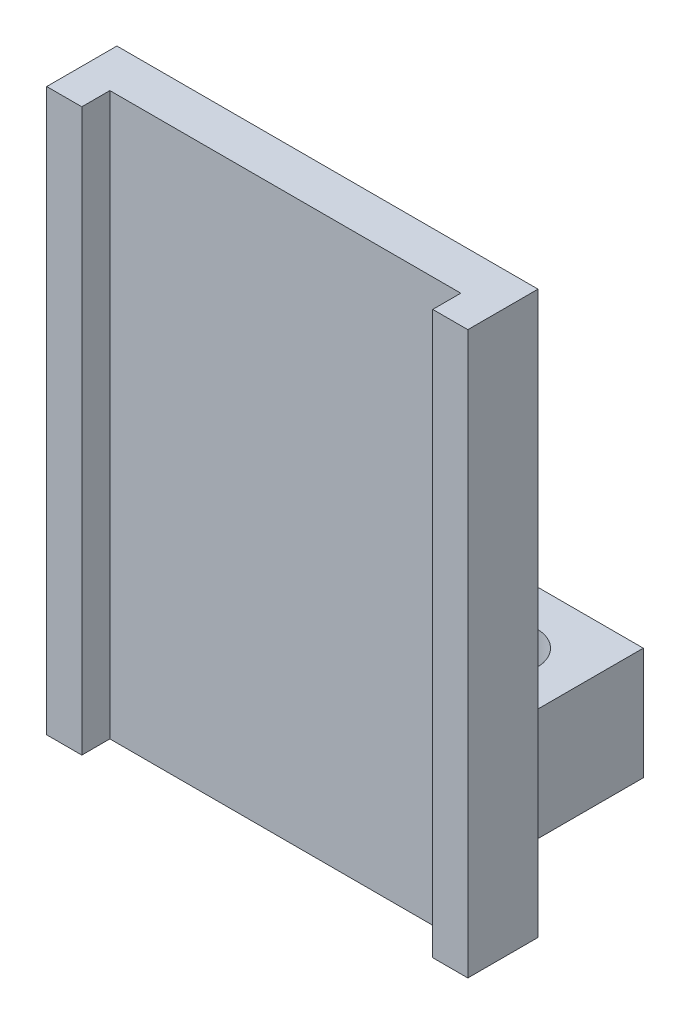
ISO-10303-21;
HEADER;
FILE_DESCRIPTION(('STEP AP214'),'2;1');
FILE_NAME('part.step','',(''),(''),'','','');
FILE_SCHEMA(('AUTOMOTIVE_DESIGN { 1 0 10303 214 1 1 1 1 }'));
ENDSEC;
DATA;
#1=APPLICATION_CONTEXT('core data for automotive mechanical design processes');
#2=APPLICATION_PROTOCOL_DEFINITION('international standard','automotive_design',2000,#1);
#3=PRODUCT_CONTEXT('',#1,'mechanical');
#4=PRODUCT('Part','Part','',(#3));
#5=PRODUCT_RELATED_PRODUCT_CATEGORY('part','',(#4));
#6=PRODUCT_DEFINITION_FORMATION('','',#4);
#7=PRODUCT_DEFINITION_CONTEXT('part definition',#1,'design');
#8=PRODUCT_DEFINITION('design','',#6,#7);
#9=PRODUCT_DEFINITION_SHAPE('','',#8);
#10=(LENGTH_UNIT() NAMED_UNIT(*) SI_UNIT(.MILLI.,.METRE.));
#11=(NAMED_UNIT(*) PLANE_ANGLE_UNIT() SI_UNIT($,.RADIAN.));
#12=(NAMED_UNIT(*) SI_UNIT($,.STERADIAN.) SOLID_ANGLE_UNIT());
#13=UNCERTAINTY_MEASURE_WITH_UNIT(LENGTH_MEASURE(1.E-05),#10,'distance_accuracy_value','');
#14=(GEOMETRIC_REPRESENTATION_CONTEXT(3) GLOBAL_UNCERTAINTY_ASSIGNED_CONTEXT((#13)) GLOBAL_UNIT_ASSIGNED_CONTEXT((#10,
#11,#12)) REPRESENTATION_CONTEXT('',''));
#15=CARTESIAN_POINT('',(0.,0.,0.));
#16=DIRECTION('',(0.,0.,1.));
#17=DIRECTION('',(1.,0.,0.));
#18=AXIS2_PLACEMENT_3D('',#15,#16,#17);
#19=CARTESIAN_POINT('',(3.125,-2.1,-2.5));
#20=DIRECTION('',(-1.,0.,0.));
#21=DIRECTION('',(0.,0.,1.));
#22=AXIS2_PLACEMENT_3D('',#19,#20,#21);
#23=PLANE('',#22);
#24=DIRECTION('',(0.,0.,-1.));
#25=VECTOR('',#24,1.);
#26=CARTESIAN_POINT('',(3.125,-4.1,-2.5));
#27=LINE('',#26,#25);
#28=CARTESIAN_POINT('',(3.125,-4.1,0.));
#29=VERTEX_POINT('',#28);
#30=CARTESIAN_POINT('',(3.125,-4.1,-2.5));
#31=VERTEX_POINT('',#30);
#32=EDGE_CURVE('P0_E80',#29,#31,#27,.T.);
#33=ORIENTED_EDGE('',*,*,#32,.T.);
#34=DIRECTION('',(0.,-1.,0.));
#35=VECTOR('',#34,1.);
#36=CARTESIAN_POINT('',(3.125,-2.1,-2.5));
#37=LINE('',#36,#35);
#38=CARTESIAN_POINT('',(3.125,-2.1,-2.5));
#39=VERTEX_POINT('',#38);
#40=EDGE_CURVE('P0_E11',#39,#31,#37,.T.);
#41=ORIENTED_EDGE('',*,*,#40,.F.);
#42=DIRECTION('',(0.,0.,-1.));
#43=VECTOR('',#42,1.);
#44=CARTESIAN_POINT('',(3.125,-2.1,-2.5));
#45=LINE('',#44,#43);
#46=CARTESIAN_POINT('',(3.125,-2.1,0.));
#47=VERTEX_POINT('',#46);
#48=EDGE_CURVE('P0_E68',#47,#39,#45,.T.);
#49=ORIENTED_EDGE('',*,*,#48,.F.);
#50=DIRECTION('',(0.,-1.,0.));
#51=VECTOR('',#50,1.);
#52=CARTESIAN_POINT('',(3.125,-2.1,0.));
#53=LINE('',#52,#51);
#54=EDGE_CURVE('P0_E76',#47,#29,#53,.T.);
#55=ORIENTED_EDGE('',*,*,#54,.T.);
#56=EDGE_LOOP('',(#33,#41,#49,#55));
#57=FACE_BOUND('',#56,.T.);
#58=ADVANCED_FACE('P0_F17',(#57),#23,.F.);
#59=CARTESIAN_POINT('',(0.625000000000001,-2.1,-2.5));
#60=DIRECTION('',(0.,0.,1.));
#61=DIRECTION('',(1.,0.,0.));
#62=AXIS2_PLACEMENT_3D('',#59,#60,#61);
#63=PLANE('',#62);
#64=DIRECTION('',(-1.,0.,0.));
#65=VECTOR('',#64,1.);
#66=CARTESIAN_POINT('',(0.625000000000001,-4.1,-2.5));
#67=LINE('',#66,#65);
#68=CARTESIAN_POINT('',(0.625000000000001,-4.1,-2.5));
#69=VERTEX_POINT('',#68);
#70=EDGE_CURVE('P0_E72',#31,#69,#67,.T.);
#71=ORIENTED_EDGE('',*,*,#70,.T.);
#72=DIRECTION('',(0.,-1.,0.));
#73=VECTOR('',#72,1.);
#74=CARTESIAN_POINT('',(0.625000000000001,-2.1,-2.5));
#75=LINE('',#74,#73);
#76=CARTESIAN_POINT('',(0.625000000000001,-2.1,-2.5));
#77=VERTEX_POINT('',#76);
#78=EDGE_CURVE('P0_E25',#77,#69,#75,.T.);
#79=ORIENTED_EDGE('',*,*,#78,.F.);
#80=DIRECTION('',(-1.,0.,0.));
#81=VECTOR('',#80,1.);
#82=CARTESIAN_POINT('',(0.625000000000001,-2.1,-2.5));
#83=LINE('',#82,#81);
#84=EDGE_CURVE('P0_E63',#39,#77,#83,.T.);
#85=ORIENTED_EDGE('',*,*,#84,.F.);
#86=ORIENTED_EDGE('',*,*,#40,.T.);
#87=EDGE_LOOP('',(#71,#79,#85,#86));
#88=FACE_BOUND('',#87,.T.);
#89=ADVANCED_FACE('P0_F71',(#88),#63,.F.);
#90=CARTESIAN_POINT('',(0.625000000000001,-2.1,-2.5));
#91=DIRECTION('',(1.,0.,0.));
#92=DIRECTION('',(0.,0.,-1.));
#93=AXIS2_PLACEMENT_3D('',#90,#91,#92);
#94=PLANE('',#93);
#95=DIRECTION('',(0.,0.,1.));
#96=VECTOR('',#95,1.);
#97=CARTESIAN_POINT('',(0.625000000000001,-4.1,-2.5));
#98=LINE('',#97,#96);
#99=CARTESIAN_POINT('',(0.625000000000001,-4.1,0.));
#100=VERTEX_POINT('',#99);
#101=EDGE_CURVE('P0_E50',#69,#100,#98,.T.);
#102=ORIENTED_EDGE('',*,*,#101,.T.);
#103=DIRECTION('',(0.,-1.,0.));
#104=VECTOR('',#103,1.);
#105=CARTESIAN_POINT('',(0.625000000000001,-2.1,0.));
#106=LINE('',#105,#104);
#107=CARTESIAN_POINT('',(0.625000000000001,-2.1,0.));
#108=VERTEX_POINT('',#107);
#109=EDGE_CURVE('P0_E73',#108,#100,#106,.T.);
#110=ORIENTED_EDGE('',*,*,#109,.F.);
#111=DIRECTION('',(0.,0.,1.));
#112=VECTOR('',#111,1.);
#113=CARTESIAN_POINT('',(0.625000000000001,-2.1,-2.5));
#114=LINE('',#113,#112);
#115=EDGE_CURVE('P0_E66',#77,#108,#114,.T.);
#116=ORIENTED_EDGE('',*,*,#115,.F.);
#117=ORIENTED_EDGE('',*,*,#78,.T.);
#118=EDGE_LOOP('',(#102,#110,#116,#117));
#119=FACE_BOUND('',#118,.T.);
#120=ADVANCED_FACE('P0_F74',(#119),#94,.F.);
#121=CARTESIAN_POINT('',(0.625000000000001,-2.1,0.));
#122=DIRECTION('',(0.,0.,-1.));
#123=DIRECTION('',(-1.,0.,0.));
#124=AXIS2_PLACEMENT_3D('',#121,#122,#123);
#125=PLANE('',#124);
#126=DIRECTION('',(1.,0.,0.));
#127=VECTOR('',#126,1.);
#128=CARTESIAN_POINT('',(0.625000000000001,-4.1,0.));
#129=LINE('',#128,#127);
#130=EDGE_CURVE('P0_E56',#100,#29,#129,.T.);
#131=ORIENTED_EDGE('',*,*,#130,.T.);
#132=ORIENTED_EDGE('',*,*,#54,.F.);
#133=DIRECTION('',(1.,0.,0.));
#134=VECTOR('',#133,1.);
#135=CARTESIAN_POINT('',(0.625000000000001,-2.1,0.));
#136=LINE('',#135,#134);
#137=EDGE_CURVE('P0_E33',#108,#47,#136,.T.);
#138=ORIENTED_EDGE('',*,*,#137,.F.);
#139=ORIENTED_EDGE('',*,*,#109,.T.);
#140=EDGE_LOOP('',(#131,#132,#138,#139));
#141=FACE_BOUND('',#140,.T.);
#142=ADVANCED_FACE('P0_F88',(#141),#125,.F.);
#143=CARTESIAN_POINT('',(1.875,-2.1,-1.25));
#144=DIRECTION('',(0.,1.,0.));
#145=DIRECTION('',(0.,0.,1.));
#146=AXIS2_PLACEMENT_3D('',#143,#144,#145);
#147=PLANE('',#146);
#148=CARTESIAN_POINT('',(1.875,-2.1,-1.25));
#149=DIRECTION('',(0.,-1.,0.));
#150=DIRECTION('',(0.,0.,-1.));
#151=AXIS2_PLACEMENT_3D('',#148,#149,#150);
#152=CIRCLE('',#151,0.599999999999999);
#153=CARTESIAN_POINT('',(1.875,-2.1,-1.85));
#154=VERTEX_POINT('',#153);
#155=EDGE_CURVE('P0_E83',#154,#154,#152,.T.);
#156=ORIENTED_EDGE('',*,*,#155,.T.);
#157=EDGE_LOOP('',(#156));
#158=FACE_BOUND('',#157,.T.);
#159=ORIENTED_EDGE('',*,*,#48,.T.);
#160=ORIENTED_EDGE('',*,*,#84,.T.);
#161=ORIENTED_EDGE('',*,*,#115,.T.);
#162=ORIENTED_EDGE('',*,*,#137,.T.);
#163=EDGE_LOOP('',(#159,#160,#161,#162));
#164=FACE_BOUND('',#163,.T.);
#165=ADVANCED_FACE('P0_F64',(#158,#164),#147,.T.);
#166=CARTESIAN_POINT('',(1.875,-4.1,-1.25));
#167=DIRECTION('',(0.,1.,0.));
#168=DIRECTION('',(0.,0.,1.));
#169=AXIS2_PLACEMENT_3D('',#166,#167,#168);
#170=PLANE('',#169);
#171=CARTESIAN_POINT('',(1.875,-4.1,-1.25));
#172=DIRECTION('',(0.,-1.,0.));
#173=DIRECTION('',(0.,0.,-1.));
#174=AXIS2_PLACEMENT_3D('',#171,#172,#173);
#175=CIRCLE('',#174,0.599999999999988);
#176=CARTESIAN_POINT('',(1.875,-4.1,-1.84999999999999));
#177=VERTEX_POINT('',#176);
#178=EDGE_CURVE('P0_E96',#177,#177,#175,.T.);
#179=ORIENTED_EDGE('',*,*,#178,.F.);
#180=EDGE_LOOP('',(#179));
#181=FACE_BOUND('',#180,.T.);
#182=ORIENTED_EDGE('',*,*,#32,.F.);
#183=ORIENTED_EDGE('',*,*,#130,.F.);
#184=ORIENTED_EDGE('',*,*,#101,.F.);
#185=ORIENTED_EDGE('',*,*,#70,.F.);
#186=EDGE_LOOP('',(#182,#183,#184,#185));
#187=FACE_BOUND('',#186,.T.);
#188=ADVANCED_FACE('P0_F91',(#181,#187),#170,.F.);
#189=CARTESIAN_POINT('',(1.875,-4.1,-1.25));
#190=DIRECTION('',(0.,-1.,0.));
#191=DIRECTION('',(0.,0.,-1.));
#192=AXIS2_PLACEMENT_3D('',#189,#190,#191);
#193=CYLINDRICAL_SURFACE('',#192,0.599999999999993);
#194=ORIENTED_EDGE('',*,*,#155,.F.);
#195=EDGE_LOOP('',(#194));
#196=FACE_BOUND('',#195,.T.);
#197=ORIENTED_EDGE('',*,*,#178,.T.);
#198=EDGE_LOOP('',(#197));
#199=FACE_BOUND('',#198,.T.);
#200=ADVANCED_FACE('P0_F100',(#196,#199),#193,.F.);
#201=CLOSED_SHELL('',(#58,#89,#120,#142,#165,#188,#200));
#202=MANIFOLD_SOLID_BREP('P0_B1',#201);
#203=CARTESIAN_POINT('',(-3.125,-2.1,0.));
#204=DIRECTION('',(1.,0.,0.));
#205=DIRECTION('',(0.,0.,-1.));
#206=AXIS2_PLACEMENT_3D('',#203,#204,#205);
#207=PLANE('',#206);
#208=DIRECTION('',(0.,0.,1.));
#209=VECTOR('',#208,1.);
#210=CARTESIAN_POINT('',(-3.125,-4.1,0.));
#211=LINE('',#210,#209);
#212=CARTESIAN_POINT('',(-3.125,-4.1,-2.5));
#213=VERTEX_POINT('',#212);
#214=CARTESIAN_POINT('',(-3.125,-4.1,0.));
#215=VERTEX_POINT('',#214);
#216=EDGE_CURVE('P1_E79',#213,#215,#211,.T.);
#217=ORIENTED_EDGE('',*,*,#216,.T.);
#218=DIRECTION('',(0.,-1.,0.));
#219=VECTOR('',#218,1.);
#220=CARTESIAN_POINT('',(-3.125,-2.1,0.));
#221=LINE('',#220,#219);
#222=CARTESIAN_POINT('',(-3.125,-2.1,0.));
#223=VERTEX_POINT('',#222);
#224=EDGE_CURVE('P1_E10',#223,#215,#221,.T.);
#225=ORIENTED_EDGE('',*,*,#224,.F.);
#226=DIRECTION('',(0.,0.,1.));
#227=VECTOR('',#226,1.);
#228=CARTESIAN_POINT('',(-3.125,-2.1,0.));
#229=LINE('',#228,#227);
#230=CARTESIAN_POINT('',(-3.125,-2.1,-2.5));
#231=VERTEX_POINT('',#230);
#232=EDGE_CURVE('P1_E67',#231,#223,#229,.T.);
#233=ORIENTED_EDGE('',*,*,#232,.F.);
#234=DIRECTION('',(0.,-1.,0.));
#235=VECTOR('',#234,1.);
#236=CARTESIAN_POINT('',(-3.125,-2.1,-2.5));
#237=LINE('',#236,#235);
#238=EDGE_CURVE('P1_E75',#231,#213,#237,.T.);
#239=ORIENTED_EDGE('',*,*,#238,.T.);
#240=EDGE_LOOP('',(#217,#225,#233,#239));
#241=FACE_BOUND('',#240,.T.);
#242=ADVANCED_FACE('P1_F16',(#241),#207,.F.);
#243=CARTESIAN_POINT('',(-0.625000000000001,-2.1,0.));
#244=DIRECTION('',(0.,0.,-1.));
#245=DIRECTION('',(-1.,0.,0.));
#246=AXIS2_PLACEMENT_3D('',#243,#244,#245);
#247=PLANE('',#246);
#248=DIRECTION('',(1.,0.,0.));
#249=VECTOR('',#248,1.);
#250=CARTESIAN_POINT('',(-0.625000000000001,-4.1,0.));
#251=LINE('',#250,#249);
#252=CARTESIAN_POINT('',(-0.625000000000001,-4.1,0.));
#253=VERTEX_POINT('',#252);
#254=EDGE_CURVE('P1_E71',#215,#253,#251,.T.);
#255=ORIENTED_EDGE('',*,*,#254,.T.);
#256=DIRECTION('',(0.,-1.,0.));
#257=VECTOR('',#256,1.);
#258=CARTESIAN_POINT('',(-0.625000000000001,-2.1,0.));
#259=LINE('',#258,#257);
#260=CARTESIAN_POINT('',(-0.625000000000001,-2.1,0.));
#261=VERTEX_POINT('',#260);
#262=EDGE_CURVE('P1_E24',#261,#253,#259,.T.);
#263=ORIENTED_EDGE('',*,*,#262,.F.);
#264=DIRECTION('',(1.,0.,0.));
#265=VECTOR('',#264,1.);
#266=CARTESIAN_POINT('',(-0.625000000000001,-2.1,0.));
#267=LINE('',#266,#265);
#268=EDGE_CURVE('P1_E62',#223,#261,#267,.T.);
#269=ORIENTED_EDGE('',*,*,#268,.F.);
#270=ORIENTED_EDGE('',*,*,#224,.T.);
#271=EDGE_LOOP('',(#255,#263,#269,#270));
#272=FACE_BOUND('',#271,.T.);
#273=ADVANCED_FACE('P1_F70',(#272),#247,.F.);
#274=CARTESIAN_POINT('',(-0.625000000000001,-2.1,0.));
#275=DIRECTION('',(-1.,0.,0.));
#276=DIRECTION('',(0.,0.,1.));
#277=AXIS2_PLACEMENT_3D('',#274,#275,#276);
#278=PLANE('',#277);
#279=DIRECTION('',(0.,0.,-1.));
#280=VECTOR('',#279,1.);
#281=CARTESIAN_POINT('',(-0.625000000000001,-4.1,0.));
#282=LINE('',#281,#280);
#283=CARTESIAN_POINT('',(-0.625000000000001,-4.1,-2.5));
#284=VERTEX_POINT('',#283);
#285=EDGE_CURVE('P1_E49',#253,#284,#282,.T.);
#286=ORIENTED_EDGE('',*,*,#285,.T.);
#287=DIRECTION('',(0.,-1.,0.));
#288=VECTOR('',#287,1.);
#289=CARTESIAN_POINT('',(-0.625000000000001,-2.1,-2.5));
#290=LINE('',#289,#288);
#291=CARTESIAN_POINT('',(-0.625000000000001,-2.1,-2.5));
#292=VERTEX_POINT('',#291);
#293=EDGE_CURVE('P1_E72',#292,#284,#290,.T.);
#294=ORIENTED_EDGE('',*,*,#293,.F.);
#295=DIRECTION('',(0.,0.,-1.));
#296=VECTOR('',#295,1.);
#297=CARTESIAN_POINT('',(-0.625000000000001,-2.1,0.));
#298=LINE('',#297,#296);
#299=EDGE_CURVE('P1_E65',#261,#292,#298,.T.);
#300=ORIENTED_EDGE('',*,*,#299,.F.);
#301=ORIENTED_EDGE('',*,*,#262,.T.);
#302=EDGE_LOOP('',(#286,#294,#300,#301));
#303=FACE_BOUND('',#302,.T.);
#304=ADVANCED_FACE('P1_F73',(#303),#278,.F.);
#305=CARTESIAN_POINT('',(-0.625000000000001,-2.1,-2.5));
#306=DIRECTION('',(0.,0.,1.));
#307=DIRECTION('',(1.,0.,0.));
#308=AXIS2_PLACEMENT_3D('',#305,#306,#307);
#309=PLANE('',#308);
#310=DIRECTION('',(-1.,0.,0.));
#311=VECTOR('',#310,1.);
#312=CARTESIAN_POINT('',(-0.625000000000001,-4.1,-2.5));
#313=LINE('',#312,#311);
#314=EDGE_CURVE('P1_E55',#284,#213,#313,.T.);
#315=ORIENTED_EDGE('',*,*,#314,.T.);
#316=ORIENTED_EDGE('',*,*,#238,.F.);
#317=DIRECTION('',(-1.,0.,0.));
#318=VECTOR('',#317,1.);
#319=CARTESIAN_POINT('',(-0.625000000000001,-2.1,-2.5));
#320=LINE('',#319,#318);
#321=EDGE_CURVE('P1_E32',#292,#231,#320,.T.);
#322=ORIENTED_EDGE('',*,*,#321,.F.);
#323=ORIENTED_EDGE('',*,*,#293,.T.);
#324=EDGE_LOOP('',(#315,#316,#322,#323));
#325=FACE_BOUND('',#324,.T.);
#326=ADVANCED_FACE('P1_F87',(#325),#309,.F.);
#327=CARTESIAN_POINT('',(-1.875,-2.1,-1.25));
#328=DIRECTION('',(0.,1.,0.));
#329=DIRECTION('',(0.,0.,-1.));
#330=AXIS2_PLACEMENT_3D('',#327,#328,#329);
#331=PLANE('',#330);
#332=CARTESIAN_POINT('',(-1.875,-2.1,-1.25));
#333=DIRECTION('',(0.,-1.,0.));
#334=DIRECTION('',(0.,0.,1.));
#335=AXIS2_PLACEMENT_3D('',#332,#333,#334);
#336=CIRCLE('',#335,0.599999999999999);
#337=CARTESIAN_POINT('',(-1.875,-2.1,-0.650000000000001));
#338=VERTEX_POINT('',#337);
#339=EDGE_CURVE('P1_E82',#338,#338,#336,.T.);
#340=ORIENTED_EDGE('',*,*,#339,.T.);
#341=EDGE_LOOP('',(#340));
#342=FACE_BOUND('',#341,.T.);
#343=ORIENTED_EDGE('',*,*,#232,.T.);
#344=ORIENTED_EDGE('',*,*,#268,.T.);
#345=ORIENTED_EDGE('',*,*,#299,.T.);
#346=ORIENTED_EDGE('',*,*,#321,.T.);
#347=EDGE_LOOP('',(#343,#344,#345,#346));
#348=FACE_BOUND('',#347,.T.);
#349=ADVANCED_FACE('P1_F63',(#342,#348),#331,.T.);
#350=CARTESIAN_POINT('',(-1.875,-4.1,-1.25));
#351=DIRECTION('',(0.,1.,0.));
#352=DIRECTION('',(0.,0.,-1.));
#353=AXIS2_PLACEMENT_3D('',#350,#351,#352);
#354=PLANE('',#353);
#355=CARTESIAN_POINT('',(-1.875,-4.1,-1.25));
#356=DIRECTION('',(0.,-1.,0.));
#357=DIRECTION('',(0.,0.,1.));
#358=AXIS2_PLACEMENT_3D('',#355,#356,#357);
#359=CIRCLE('',#358,0.599999999999988);
#360=CARTESIAN_POINT('',(-1.875,-4.1,-0.650000000000013));
#361=VERTEX_POINT('',#360);
#362=EDGE_CURVE('P1_E95',#361,#361,#359,.T.);
#363=ORIENTED_EDGE('',*,*,#362,.F.);
#364=EDGE_LOOP('',(#363));
#365=FACE_BOUND('',#364,.T.);
#366=ORIENTED_EDGE('',*,*,#216,.F.);
#367=ORIENTED_EDGE('',*,*,#314,.F.);
#368=ORIENTED_EDGE('',*,*,#285,.F.);
#369=ORIENTED_EDGE('',*,*,#254,.F.);
#370=EDGE_LOOP('',(#366,#367,#368,#369));
#371=FACE_BOUND('',#370,.T.);
#372=ADVANCED_FACE('P1_F90',(#365,#371),#354,.F.);
#373=CARTESIAN_POINT('',(-1.875,-4.1,-1.25));
#374=DIRECTION('',(0.,-1.,0.));
#375=DIRECTION('',(0.,0.,1.));
#376=AXIS2_PLACEMENT_3D('',#373,#374,#375);
#377=CYLINDRICAL_SURFACE('',#376,0.599999999999993);
#378=ORIENTED_EDGE('',*,*,#339,.F.);
#379=EDGE_LOOP('',(#378));
#380=FACE_BOUND('',#379,.T.);
#381=ORIENTED_EDGE('',*,*,#362,.T.);
#382=EDGE_LOOP('',(#381));
#383=FACE_BOUND('',#382,.T.);
#384=ADVANCED_FACE('P1_F99',(#380,#383),#377,.F.);
#385=CLOSED_SHELL('',(#242,#273,#304,#326,#349,#372,#384));
#386=MANIFOLD_SOLID_BREP('P1_B1',#385);
#387=CARTESIAN_POINT('',(0.,5.,0.75));
#388=DIRECTION('',(0.,1.,0.));
#389=DIRECTION('',(0.,0.,1.));
#390=AXIS2_PLACEMENT_3D('',#387,#388,#389);
#391=PLANE('',#390);
#392=DIRECTION('',(1.,0.,0.));
#393=VECTOR('',#392,1.);
#394=CARTESIAN_POINT('',(0.,5.,0.));
#395=LINE('',#394,#393);
#396=CARTESIAN_POINT('',(-3.75,5.,0.));
#397=VERTEX_POINT('',#396);
#398=CARTESIAN_POINT('',(3.75,5.,0.));
#399=VERTEX_POINT('',#398);
#400=EDGE_CURVE('P2_E137',#397,#399,#395,.T.);
#401=ORIENTED_EDGE('',*,*,#400,.F.);
#402=DIRECTION('',(0.,0.,-1.));
#403=VECTOR('',#402,1.);
#404=CARTESIAN_POINT('',(-3.75,5.,1.25));
#405=LINE('',#404,#403);
#406=CARTESIAN_POINT('',(-3.75,5.,1.25));
#407=VERTEX_POINT('',#406);
#408=EDGE_CURVE('P2_E89',#407,#397,#405,.T.);
#409=ORIENTED_EDGE('',*,*,#408,.F.);
#410=DIRECTION('',(1.,0.,0.));
#411=VECTOR('',#410,1.);
#412=CARTESIAN_POINT('',(0.,5.,1.25));
#413=LINE('',#412,#411);
#414=CARTESIAN_POINT('',(-3.125,5.,1.25));
#415=VERTEX_POINT('',#414);
#416=EDGE_CURVE('P2_E94',#407,#415,#413,.T.);
#417=ORIENTED_EDGE('',*,*,#416,.T.);
#418=DIRECTION('',(0.,0.,-1.));
#419=VECTOR('',#418,1.);
#420=CARTESIAN_POINT('',(-3.125,5.,1.25));
#421=LINE('',#420,#419);
#422=CARTESIAN_POINT('',(-3.125,5.,0.75));
#423=VERTEX_POINT('',#422);
#424=EDGE_CURVE('P2_E82',#415,#423,#421,.T.);
#425=ORIENTED_EDGE('',*,*,#424,.T.);
#426=DIRECTION('',(1.,0.,0.));
#427=VECTOR('',#426,1.);
#428=CARTESIAN_POINT('',(0.,5.,0.75));
#429=LINE('',#428,#427);
#430=CARTESIAN_POINT('',(3.125,5.,0.75));
#431=VERTEX_POINT('',#430);
#432=EDGE_CURVE('P2_E139',#423,#431,#429,.T.);
#433=ORIENTED_EDGE('',*,*,#432,.T.);
#434=DIRECTION('',(0.,0.,-1.));
#435=VECTOR('',#434,1.);
#436=CARTESIAN_POINT('',(3.125,5.,1.25));
#437=LINE('',#436,#435);
#438=CARTESIAN_POINT('',(3.125,5.,1.25));
#439=VERTEX_POINT('',#438);
#440=EDGE_CURVE('P2_E134',#439,#431,#437,.T.);
#441=ORIENTED_EDGE('',*,*,#440,.F.);
#442=DIRECTION('',(1.,0.,0.));
#443=VECTOR('',#442,1.);
#444=CARTESIAN_POINT('',(0.,5.,1.25));
#445=LINE('',#444,#443);
#446=CARTESIAN_POINT('',(3.75,5.,1.25));
#447=VERTEX_POINT('',#446);
#448=EDGE_CURVE('P2_E113',#439,#447,#445,.T.);
#449=ORIENTED_EDGE('',*,*,#448,.T.);
#450=DIRECTION('',(0.,0.,-1.));
#451=VECTOR('',#450,1.);
#452=CARTESIAN_POINT('',(3.75,5.,1.25));
#453=LINE('',#452,#451);
#454=EDGE_CURVE('P2_E123',#447,#399,#453,.T.);
#455=ORIENTED_EDGE('',*,*,#454,.T.);
#456=EDGE_LOOP('',(#401,#409,#417,#425,#433,#441,#449,#455));
#457=FACE_BOUND('',#456,.T.);
#458=ADVANCED_FACE('P2_F17',(#457),#391,.T.);
#459=CARTESIAN_POINT('',(0.,-5.,0.75));
#460=DIRECTION('',(0.,1.,0.));
#461=DIRECTION('',(0.,0.,1.));
#462=AXIS2_PLACEMENT_3D('',#459,#460,#461);
#463=PLANE('',#462);
#464=DIRECTION('',(1.,0.,0.));
#465=VECTOR('',#464,1.);
#466=CARTESIAN_POINT('',(0.,-5.,0.));
#467=LINE('',#466,#465);
#468=CARTESIAN_POINT('',(-3.75,-5.,0.));
#469=VERTEX_POINT('',#468);
#470=CARTESIAN_POINT('',(3.75,-5.,0.));
#471=VERTEX_POINT('',#470);
#472=EDGE_CURVE('P2_E20',#469,#471,#467,.T.);
#473=ORIENTED_EDGE('',*,*,#472,.T.);
#474=DIRECTION('',(0.,0.,-1.));
#475=VECTOR('',#474,1.);
#476=CARTESIAN_POINT('',(3.75,-5.,1.25));
#477=LINE('',#476,#475);
#478=CARTESIAN_POINT('',(3.75,-5.,1.25));
#479=VERTEX_POINT('',#478);
#480=EDGE_CURVE('P2_E128',#479,#471,#477,.T.);
#481=ORIENTED_EDGE('',*,*,#480,.F.);
#482=DIRECTION('',(1.,0.,0.));
#483=VECTOR('',#482,1.);
#484=CARTESIAN_POINT('',(0.,-5.,1.25));
#485=LINE('',#484,#483);
#486=CARTESIAN_POINT('',(3.125,-5.,1.25));
#487=VERTEX_POINT('',#486);
#488=EDGE_CURVE('P2_E118',#487,#479,#485,.T.);
#489=ORIENTED_EDGE('',*,*,#488,.F.);
#490=DIRECTION('',(0.,0.,-1.));
#491=VECTOR('',#490,1.);
#492=CARTESIAN_POINT('',(3.125,-5.,1.25));
#493=LINE('',#492,#491);
#494=CARTESIAN_POINT('',(3.125,-5.,0.75));
#495=VERTEX_POINT('',#494);
#496=EDGE_CURVE('P2_E131',#487,#495,#493,.T.);
#497=ORIENTED_EDGE('',*,*,#496,.T.);
#498=DIRECTION('',(1.,0.,0.));
#499=VECTOR('',#498,1.);
#500=CARTESIAN_POINT('',(0.,-5.,0.75));
#501=LINE('',#500,#499);
#502=CARTESIAN_POINT('',(-3.125,-5.,0.75));
#503=VERTEX_POINT('',#502);
#504=EDGE_CURVE('P2_E11',#503,#495,#501,.T.);
#505=ORIENTED_EDGE('',*,*,#504,.F.);
#506=DIRECTION('',(0.,0.,-1.));
#507=VECTOR('',#506,1.);
#508=CARTESIAN_POINT('',(-3.125,-5.,1.25));
#509=LINE('',#508,#507);
#510=CARTESIAN_POINT('',(-3.125,-5.,1.25));
#511=VERTEX_POINT('',#510);
#512=EDGE_CURVE('P2_E33',#511,#503,#509,.T.);
#513=ORIENTED_EDGE('',*,*,#512,.F.);
#514=DIRECTION('',(1.,0.,0.));
#515=VECTOR('',#514,1.);
#516=CARTESIAN_POINT('',(0.,-5.,1.25));
#517=LINE('',#516,#515);
#518=CARTESIAN_POINT('',(-3.75,-5.,1.25));
#519=VERTEX_POINT('',#518);
#520=EDGE_CURVE('P2_E96',#519,#511,#517,.T.);
#521=ORIENTED_EDGE('',*,*,#520,.F.);
#522=DIRECTION('',(0.,0.,-1.));
#523=VECTOR('',#522,1.);
#524=CARTESIAN_POINT('',(-3.75,-5.,1.25));
#525=LINE('',#524,#523);
#526=EDGE_CURVE('P2_E109',#519,#469,#525,.T.);
#527=ORIENTED_EDGE('',*,*,#526,.T.);
#528=EDGE_LOOP('',(#473,#481,#489,#497,#505,#513,#521,#527));
#529=FACE_BOUND('',#528,.T.);
#530=ADVANCED_FACE('P2_F145',(#529),#463,.F.);
#531=CARTESIAN_POINT('',(0.,0.,0.75));
#532=DIRECTION('',(0.,0.,1.));
#533=DIRECTION('',(1.,0.,0.));
#534=AXIS2_PLACEMENT_3D('',#531,#532,#533);
#535=PLANE('',#534);
#536=DIRECTION('',(0.,-1.,0.));
#537=VECTOR('',#536,1.);
#538=CARTESIAN_POINT('',(3.125,0.,0.75));
#539=LINE('',#538,#537);
#540=EDGE_CURVE('P2_E40',#431,#495,#539,.T.);
#541=ORIENTED_EDGE('',*,*,#540,.F.);
#542=ORIENTED_EDGE('',*,*,#432,.F.);
#543=DIRECTION('',(0.,-1.,0.));
#544=VECTOR('',#543,1.);
#545=CARTESIAN_POINT('',(-3.125,0.,0.75));
#546=LINE('',#545,#544);
#547=EDGE_CURVE('P2_E25',#423,#503,#546,.T.);
#548=ORIENTED_EDGE('',*,*,#547,.T.);
#549=ORIENTED_EDGE('',*,*,#504,.T.);
#550=EDGE_LOOP('',(#541,#542,#548,#549));
#551=FACE_BOUND('',#550,.T.);
#552=ADVANCED_FACE('P2_F155',(#551),#535,.T.);
#553=CARTESIAN_POINT('',(0.,0.,0.));
#554=DIRECTION('',(0.,0.,1.));
#555=DIRECTION('',(1.,0.,0.));
#556=AXIS2_PLACEMENT_3D('',#553,#554,#555);
#557=PLANE('',#556);
#558=ORIENTED_EDGE('',*,*,#400,.T.);
#559=DIRECTION('',(0.,-1.,0.));
#560=VECTOR('',#559,1.);
#561=CARTESIAN_POINT('',(3.75,0.,0.));
#562=LINE('',#561,#560);
#563=EDGE_CURVE('P2_E88',#399,#471,#562,.T.);
#564=ORIENTED_EDGE('',*,*,#563,.T.);
#565=ORIENTED_EDGE('',*,*,#472,.F.);
#566=DIRECTION('',(0.,-1.,0.));
#567=VECTOR('',#566,1.);
#568=CARTESIAN_POINT('',(-3.75,0.,0.));
#569=LINE('',#568,#567);
#570=EDGE_CURVE('P2_E97',#397,#469,#569,.T.);
#571=ORIENTED_EDGE('',*,*,#570,.F.);
#572=EDGE_LOOP('',(#558,#564,#565,#571));
#573=FACE_BOUND('',#572,.T.);
#574=ADVANCED_FACE('P2_F152',(#573),#557,.F.);
#575=CARTESIAN_POINT('',(3.125,0.,1.25));
#576=DIRECTION('',(1.,0.,0.));
#577=DIRECTION('',(0.,1.,0.));
#578=AXIS2_PLACEMENT_3D('',#575,#576,#577);
#579=PLANE('',#578);
#580=ORIENTED_EDGE('',*,*,#440,.T.);
#581=ORIENTED_EDGE('',*,*,#540,.T.);
#582=ORIENTED_EDGE('',*,*,#496,.F.);
#583=DIRECTION('',(0.,-1.,0.));
#584=VECTOR('',#583,1.);
#585=CARTESIAN_POINT('',(3.125,0.,1.25));
#586=LINE('',#585,#584);
#587=EDGE_CURVE('P2_E116',#439,#487,#586,.T.);
#588=ORIENTED_EDGE('',*,*,#587,.F.);
#589=EDGE_LOOP('',(#580,#581,#582,#588));
#590=FACE_BOUND('',#589,.T.);
#591=ADVANCED_FACE('P2_F154',(#590),#579,.F.);
#592=CARTESIAN_POINT('',(3.75,0.,1.25));
#593=DIRECTION('',(1.,0.,0.));
#594=DIRECTION('',(0.,1.,0.));
#595=AXIS2_PLACEMENT_3D('',#592,#593,#594);
#596=PLANE('',#595);
#597=ORIENTED_EDGE('',*,*,#563,.F.);
#598=ORIENTED_EDGE('',*,*,#454,.F.);
#599=DIRECTION('',(0.,-1.,0.));
#600=VECTOR('',#599,1.);
#601=CARTESIAN_POINT('',(3.75,0.,1.25));
#602=LINE('',#601,#600);
#603=EDGE_CURVE('P2_E120',#447,#479,#602,.T.);
#604=ORIENTED_EDGE('',*,*,#603,.T.);
#605=ORIENTED_EDGE('',*,*,#480,.T.);
#606=EDGE_LOOP('',(#597,#598,#604,#605));
#607=FACE_BOUND('',#606,.T.);
#608=ADVANCED_FACE('P2_F150',(#607),#596,.T.);
#609=CARTESIAN_POINT('',(0.,0.,1.25));
#610=DIRECTION('',(0.,0.,1.));
#611=DIRECTION('',(1.,0.,0.));
#612=AXIS2_PLACEMENT_3D('',#609,#610,#611);
#613=PLANE('',#612);
#614=ORIENTED_EDGE('',*,*,#448,.F.);
#615=ORIENTED_EDGE('',*,*,#587,.T.);
#616=ORIENTED_EDGE('',*,*,#488,.T.);
#617=ORIENTED_EDGE('',*,*,#603,.F.);
#618=EDGE_LOOP('',(#614,#615,#616,#617));
#619=FACE_BOUND('',#618,.T.);
#620=ADVANCED_FACE('P2_F202',(#619),#613,.T.);
#621=CARTESIAN_POINT('',(-3.125,0.,1.25));
#622=DIRECTION('',(1.,0.,0.));
#623=DIRECTION('',(0.,1.,0.));
#624=AXIS2_PLACEMENT_3D('',#621,#622,#623);
#625=PLANE('',#624);
#626=ORIENTED_EDGE('',*,*,#547,.F.);
#627=ORIENTED_EDGE('',*,*,#424,.F.);
#628=DIRECTION('',(0.,-1.,0.));
#629=VECTOR('',#628,1.);
#630=CARTESIAN_POINT('',(-3.125,0.,1.25));
#631=LINE('',#630,#629);
#632=EDGE_CURVE('P2_E85',#415,#511,#631,.T.);
#633=ORIENTED_EDGE('',*,*,#632,.T.);
#634=ORIENTED_EDGE('',*,*,#512,.T.);
#635=EDGE_LOOP('',(#626,#627,#633,#634));
#636=FACE_BOUND('',#635,.T.);
#637=ADVANCED_FACE('P2_F84',(#636),#625,.T.);
#638=CARTESIAN_POINT('',(-3.75,0.,1.25));
#639=DIRECTION('',(1.,0.,0.));
#640=DIRECTION('',(0.,1.,0.));
#641=AXIS2_PLACEMENT_3D('',#638,#639,#640);
#642=PLANE('',#641);
#643=ORIENTED_EDGE('',*,*,#570,.T.);
#644=ORIENTED_EDGE('',*,*,#526,.F.);
#645=DIRECTION('',(0.,-1.,0.));
#646=VECTOR('',#645,1.);
#647=CARTESIAN_POINT('',(-3.75,0.,1.25));
#648=LINE('',#647,#646);
#649=EDGE_CURVE('P2_E101',#407,#519,#648,.T.);
#650=ORIENTED_EDGE('',*,*,#649,.F.);
#651=ORIENTED_EDGE('',*,*,#408,.T.);
#652=EDGE_LOOP('',(#643,#644,#650,#651));
#653=FACE_BOUND('',#652,.T.);
#654=ADVANCED_FACE('P2_F220',(#653),#642,.F.);
#655=CARTESIAN_POINT('',(0.,0.,1.25));
#656=DIRECTION('',(0.,0.,1.));
#657=DIRECTION('',(1.,0.,0.));
#658=AXIS2_PLACEMENT_3D('',#655,#656,#657);
#659=PLANE('',#658);
#660=ORIENTED_EDGE('',*,*,#632,.F.);
#661=ORIENTED_EDGE('',*,*,#416,.F.);
#662=ORIENTED_EDGE('',*,*,#649,.T.);
#663=ORIENTED_EDGE('',*,*,#520,.T.);
#664=EDGE_LOOP('',(#660,#661,#662,#663));
#665=FACE_BOUND('',#664,.T.);
#666=ADVANCED_FACE('P2_F93',(#665),#659,.T.);
#667=CLOSED_SHELL('',(#458,#530,#552,#574,#591,#608,#620,#637,#654,#666));
#668=MANIFOLD_SOLID_BREP('P2_B1',#667);
#669=ADVANCED_BREP_SHAPE_REPRESENTATION('',(#18,#202,#386,#668),#14);
#670=SHAPE_DEFINITION_REPRESENTATION(#9,#669);
ENDSEC;
END-ISO-10303-21;
